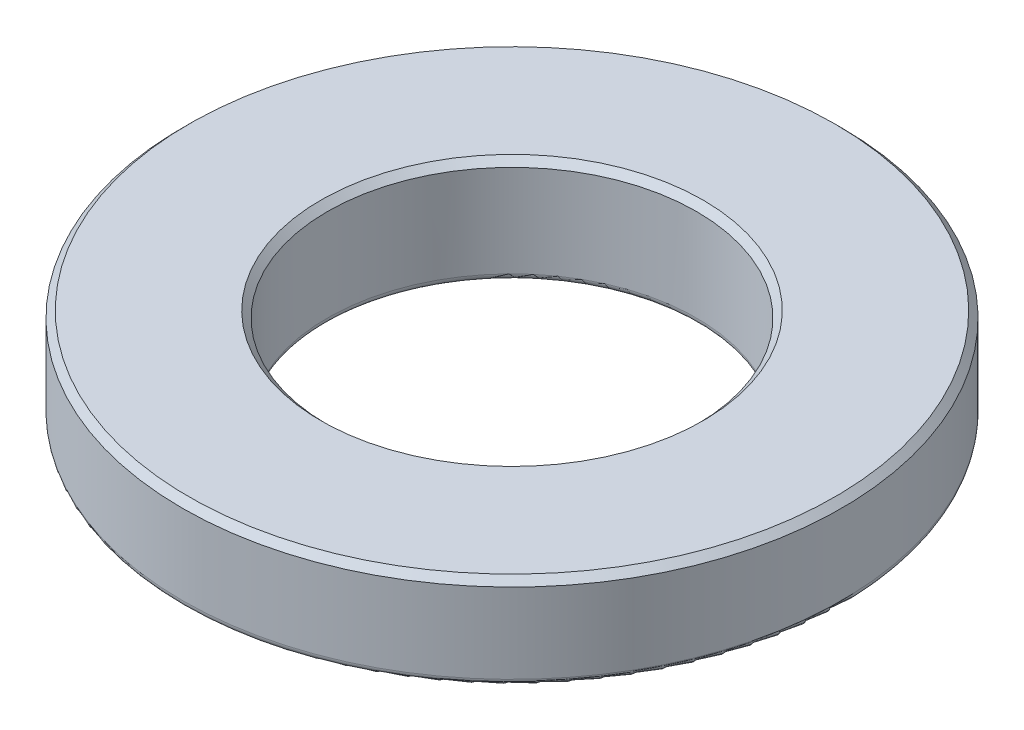
ISO-10303-21;
HEADER;
FILE_DESCRIPTION(('STEP AP214'),'2;1');
FILE_NAME('part.step','',(''),(''),'','','');
FILE_SCHEMA(('AUTOMOTIVE_DESIGN { 1 0 10303 214 1 1 1 1 }'));
ENDSEC;
DATA;
#1=APPLICATION_CONTEXT('core data for automotive mechanical design processes');
#2=APPLICATION_PROTOCOL_DEFINITION('international standard','automotive_design',2000,#1);
#3=PRODUCT_CONTEXT('',#1,'mechanical');
#4=PRODUCT('Part','Part','',(#3));
#5=PRODUCT_RELATED_PRODUCT_CATEGORY('part','',(#4));
#6=PRODUCT_DEFINITION_FORMATION('','',#4);
#7=PRODUCT_DEFINITION_CONTEXT('part definition',#1,'design');
#8=PRODUCT_DEFINITION('design','',#6,#7);
#9=PRODUCT_DEFINITION_SHAPE('','',#8);
#10=(LENGTH_UNIT() NAMED_UNIT(*) SI_UNIT(.MILLI.,.METRE.));
#11=(NAMED_UNIT(*) PLANE_ANGLE_UNIT() SI_UNIT($,.RADIAN.));
#12=(NAMED_UNIT(*) SI_UNIT($,.STERADIAN.) SOLID_ANGLE_UNIT());
#13=UNCERTAINTY_MEASURE_WITH_UNIT(LENGTH_MEASURE(1.E-05),#10,'distance_accuracy_value','');
#14=(GEOMETRIC_REPRESENTATION_CONTEXT(3) GLOBAL_UNCERTAINTY_ASSIGNED_CONTEXT((#13)) GLOBAL_UNIT_ASSIGNED_CONTEXT((#10,
#11,#12)) REPRESENTATION_CONTEXT('',''));
#15=CARTESIAN_POINT('',(0.,0.,0.));
#16=DIRECTION('',(0.,0.,1.));
#17=DIRECTION('',(1.,0.,0.));
#18=AXIS2_PLACEMENT_3D('',#15,#16,#17);
#19=CARTESIAN_POINT('',(7.11200000000001,-102.362,0.));
#20=DIRECTION('',(0.,-1.,0.));
#21=DIRECTION('',(0.,0.,-1.));
#22=AXIS2_PLACEMENT_3D('',#19,#20,#21);
#23=PLANE('',#22);
#24=CARTESIAN_POINT('',(0.,-102.362,0.));
#25=DIRECTION('',(0.,-1.,0.));
#26=DIRECTION('',(0.,0.,-1.));
#27=AXIS2_PLACEMENT_3D('',#24,#25,#26);
#28=CIRCLE('',#27,7.36600000000001);
#29=CARTESIAN_POINT('',(0.,-102.362,-7.36600000000001));
#30=VERTEX_POINT('',#29);
#31=EDGE_CURVE('E58',#30,#30,#28,.T.);
#32=ORIENTED_EDGE('',*,*,#31,.T.);
#33=EDGE_LOOP('',(#32));
#34=FACE_BOUND('',#33,.T.);
#35=CARTESIAN_POINT('',(0.,-102.362,0.));
#36=DIRECTION('',(0.,-1.,0.));
#37=DIRECTION('',(0.,0.,-1.));
#38=AXIS2_PLACEMENT_3D('',#35,#36,#37);
#39=CIRCLE('',#38,12.446);
#40=CARTESIAN_POINT('',(0.,-102.362,-12.446));
#41=VERTEX_POINT('',#40);
#42=EDGE_CURVE('E61',#41,#41,#39,.F.);
#43=ORIENTED_EDGE('',*,*,#42,.T.);
#44=EDGE_LOOP('',(#43));
#45=FACE_BOUND('',#44,.T.);
#46=ADVANCED_FACE('F35',(#34,#45),#23,.F.);
#47=CARTESIAN_POINT('',(0.,0.,0.));
#48=DIRECTION('',(0.,1.,0.));
#49=DIRECTION('',(0.,0.,1.));
#50=AXIS2_PLACEMENT_3D('',#47,#48,#49);
#51=CYLINDRICAL_SURFACE('',#50,7.11200000000003);
#52=CARTESIAN_POINT('',(0.,-106.17078468204,0.));
#53=DIRECTION('',(0.,1.,0.));
#54=DIRECTION('',(0.,0.,1.));
#55=AXIS2_PLACEMENT_3D('',#52,#53,#54);
#56=CIRCLE('',#55,7.11200000000003);
#57=CARTESIAN_POINT('',(0.,-106.17078468204,7.11200000000003));
#58=VERTEX_POINT('',#57);
#59=EDGE_CURVE('E10',#58,#58,#56,.F.);
#60=ORIENTED_EDGE('',*,*,#59,.T.);
#61=EDGE_LOOP('',(#60));
#62=FACE_BOUND('',#61,.T.);
#63=CARTESIAN_POINT('',(0.,-102.616,0.));
#64=DIRECTION('',(0.,-1.,0.));
#65=DIRECTION('',(0.,0.,-1.));
#66=AXIS2_PLACEMENT_3D('',#63,#64,#65);
#67=CIRCLE('',#66,7.11200000000003);
#68=CARTESIAN_POINT('',(0.,-102.616,-7.11200000000003));
#69=VERTEX_POINT('',#68);
#70=EDGE_CURVE('E64',#69,#69,#67,.F.);
#71=ORIENTED_EDGE('',*,*,#70,.T.);
#72=EDGE_LOOP('',(#71));
#73=FACE_BOUND('',#72,.T.);
#74=ADVANCED_FACE('F68',(#62,#73),#51,.F.);
#75=CARTESIAN_POINT('',(0.,0.,0.));
#76=DIRECTION('',(0.,1.,0.));
#77=DIRECTION('',(1.,0.,0.));
#78=AXIS2_PLACEMENT_3D('',#75,#76,#77);
#79=SPHERICAL_SURFACE('',#78,106.68);
#80=CARTESIAN_POINT('',(0.,-105.948002379824,0.));
#81=DIRECTION('',(0.,1.,0.));
#82=DIRECTION('',(0.,0.,1.));
#83=AXIS2_PLACEMENT_3D('',#80,#81,#82);
#84=CIRCLE('',#83,12.4757040572792);
#85=CARTESIAN_POINT('',(0.,-105.948002379824,12.4757040572792));
#86=VERTEX_POINT('',#85);
#87=EDGE_CURVE('E42',#86,#86,#84,.F.);
#88=ORIENTED_EDGE('',*,*,#87,.T.);
#89=EDGE_LOOP('',(#88));
#90=FACE_BOUND('',#89,.T.);
#91=CARTESIAN_POINT('',(0.,-106.424175576269,0.));
#92=DIRECTION('',(0.,1.,0.));
#93=DIRECTION('',(0.,0.,1.));
#94=AXIS2_PLACEMENT_3D('',#91,#92,#93);
#95=CIRCLE('',#94,7.38357995226733);
#96=CARTESIAN_POINT('',(0.,-106.424175576269,7.38357995226733));
#97=VERTEX_POINT('',#96);
#98=EDGE_CURVE('E46',#97,#97,#95,.T.);
#99=ORIENTED_EDGE('',*,*,#98,.T.);
#100=EDGE_LOOP('',(#99));
#101=FACE_BOUND('',#100,.T.);
#102=ADVANCED_FACE('F83',(#90,#101),#79,.T.);
#103=CARTESIAN_POINT('',(0.,0.,0.));
#104=DIRECTION('',(0.,1.,0.));
#105=DIRECTION('',(0.,0.,1.));
#106=AXIS2_PLACEMENT_3D('',#103,#104,#105);
#107=CYLINDRICAL_SURFACE('',#106,12.7);
#108=CARTESIAN_POINT('',(0.,-105.695745231301,0.));
#109=DIRECTION('',(0.,1.,0.));
#110=DIRECTION('',(0.,0.,1.));
#111=AXIS2_PLACEMENT_3D('',#108,#109,#110);
#112=CIRCLE('',#111,12.7);
#113=CARTESIAN_POINT('',(0.,-105.695745231301,12.7));
#114=VERTEX_POINT('',#113);
#115=EDGE_CURVE('E50',#114,#114,#112,.T.);
#116=ORIENTED_EDGE('',*,*,#115,.T.);
#117=EDGE_LOOP('',(#116));
#118=FACE_BOUND('',#117,.T.);
#119=CARTESIAN_POINT('',(0.,-102.616,0.));
#120=DIRECTION('',(0.,-1.,0.));
#121=DIRECTION('',(0.,0.,-1.));
#122=AXIS2_PLACEMENT_3D('',#119,#120,#121);
#123=CIRCLE('',#122,12.7);
#124=CARTESIAN_POINT('',(0.,-102.616,-12.7));
#125=VERTEX_POINT('',#124);
#126=EDGE_CURVE('E55',#125,#125,#123,.T.);
#127=ORIENTED_EDGE('',*,*,#126,.T.);
#128=EDGE_LOOP('',(#127));
#129=FACE_BOUND('',#128,.T.);
#130=ADVANCED_FACE('F73',(#118,#129),#107,.T.);
#131=CARTESIAN_POINT('',(0.,-102.616,0.));
#132=DIRECTION('',(0.,1.,0.));
#133=DIRECTION('',(0.,0.,1.));
#134=AXIS2_PLACEMENT_3D('',#131,#132,#133);
#135=CONICAL_SURFACE('',#134,7.11200000000003,0.785398163397457);
#136=ORIENTED_EDGE('',*,*,#31,.F.);
#137=EDGE_LOOP('',(#136));
#138=FACE_BOUND('',#137,.T.);
#139=ORIENTED_EDGE('',*,*,#70,.F.);
#140=EDGE_LOOP('',(#139));
#141=FACE_BOUND('',#140,.T.);
#142=ADVANCED_FACE('F70',(#138,#141),#135,.F.);
#143=CARTESIAN_POINT('',(0.,-102.362,0.));
#144=DIRECTION('',(0.,-1.,0.));
#145=DIRECTION('',(0.,0.,-1.));
#146=AXIS2_PLACEMENT_3D('',#143,#144,#145);
#147=CONICAL_SURFACE('',#146,12.446,0.785398163397448);
#148=ORIENTED_EDGE('',*,*,#126,.F.);
#149=EDGE_LOOP('',(#148));
#150=FACE_BOUND('',#149,.T.);
#151=ORIENTED_EDGE('',*,*,#42,.F.);
#152=EDGE_LOOP('',(#151));
#153=FACE_BOUND('',#152,.T.);
#154=ADVANCED_FACE('F72',(#150,#153),#147,.T.);
#155=CARTESIAN_POINT('',(0.,-105.695745231301,0.));
#156=DIRECTION('',(0.,1.,0.));
#157=DIRECTION('',(0.,0.,1.));
#158=AXIS2_PLACEMENT_3D('',#155,#156,#157);
#159=TOROIDAL_SURFACE('',#158,12.446,0.254);
#160=ORIENTED_EDGE('',*,*,#87,.F.);
#161=EDGE_LOOP('',(#160));
#162=FACE_BOUND('',#161,.T.);
#163=ORIENTED_EDGE('',*,*,#115,.F.);
#164=EDGE_LOOP('',(#163));
#165=FACE_BOUND('',#164,.T.);
#166=ADVANCED_FACE('F80',(#162,#165),#159,.T.);
#167=CARTESIAN_POINT('',(0.,-106.17078468204,0.));
#168=DIRECTION('',(0.,1.,0.));
#169=DIRECTION('',(0.,0.,1.));
#170=AXIS2_PLACEMENT_3D('',#167,#168,#169);
#171=TOROIDAL_SURFACE('',#170,7.36600000000003,0.254);
#172=ORIENTED_EDGE('',*,*,#59,.F.);
#173=EDGE_LOOP('',(#172));
#174=FACE_BOUND('',#173,.T.);
#175=ORIENTED_EDGE('',*,*,#98,.F.);
#176=EDGE_LOOP('',(#175));
#177=FACE_BOUND('',#176,.T.);
#178=ADVANCED_FACE('F37',(#174,#177),#171,.T.);
#179=CLOSED_SHELL('',(#46,#74,#102,#130,#142,#154,#166,#178));
#180=MANIFOLD_SOLID_BREP('B2',#179);
#181=ADVANCED_BREP_SHAPE_REPRESENTATION('',(#18,#180),#14);
#182=SHAPE_DEFINITION_REPRESENTATION(#9,#181);
ENDSEC;
END-ISO-10303-21;
